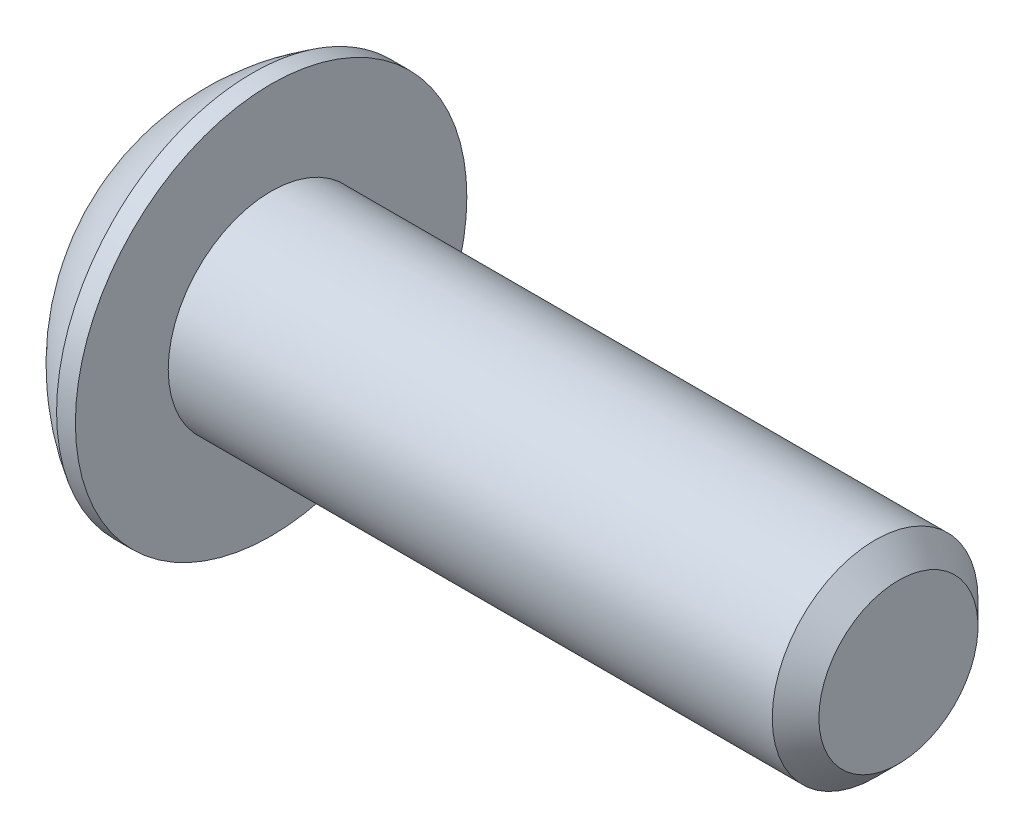
ISO-10303-21;
HEADER;
FILE_DESCRIPTION(('STEP AP214'),'2;1');
FILE_NAME('part.step','',(''),(''),'','','');
FILE_SCHEMA(('AUTOMOTIVE_DESIGN { 1 0 10303 214 1 1 1 1 }'));
ENDSEC;
DATA;
#1=APPLICATION_CONTEXT('core data for automotive mechanical design processes');
#2=APPLICATION_PROTOCOL_DEFINITION('international standard','automotive_design',2000,#1);
#3=PRODUCT_CONTEXT('',#1,'mechanical');
#4=PRODUCT('Part','Part','',(#3));
#5=PRODUCT_RELATED_PRODUCT_CATEGORY('part','',(#4));
#6=PRODUCT_DEFINITION_FORMATION('','',#4);
#7=PRODUCT_DEFINITION_CONTEXT('part definition',#1,'design');
#8=PRODUCT_DEFINITION('design','',#6,#7);
#9=PRODUCT_DEFINITION_SHAPE('','',#8);
#10=(LENGTH_UNIT() NAMED_UNIT(*) SI_UNIT(.MILLI.,.METRE.));
#11=(NAMED_UNIT(*) PLANE_ANGLE_UNIT() SI_UNIT($,.RADIAN.));
#12=(NAMED_UNIT(*) SI_UNIT($,.STERADIAN.) SOLID_ANGLE_UNIT());
#13=UNCERTAINTY_MEASURE_WITH_UNIT(LENGTH_MEASURE(1.E-05),#10,'distance_accuracy_value','');
#14=(GEOMETRIC_REPRESENTATION_CONTEXT(3) GLOBAL_UNCERTAINTY_ASSIGNED_CONTEXT((#13)) GLOBAL_UNIT_ASSIGNED_CONTEXT((#10,
#11,#12)) REPRESENTATION_CONTEXT('',''));
#15=CARTESIAN_POINT('',(0.,0.,0.));
#16=DIRECTION('',(0.,0.,1.));
#17=DIRECTION('',(1.,0.,0.));
#18=AXIS2_PLACEMENT_3D('',#15,#16,#17);
#19=CARTESIAN_POINT('',(1.32080000000034,0.,0.));
#20=DIRECTION('',(-1.,0.,0.));
#21=DIRECTION('',(0.,0.,1.));
#22=AXIS2_PLACEMENT_3D('',#19,#20,#21);
#23=CONICAL_SURFACE('',#22,1.1937999999998,1.04719755119608);
#24=CARTESIAN_POINT('',(2.01004075135902,0.,4.44089209850063E-13));
#25=VERTEX_POINT('',#24);
#26=VERTEX_LOOP('',#25);
#27=FACE_BOUND('',#26,.T.);
#28=CARTESIAN_POINT('',(1.32080000000009,0.,0.));
#29=DIRECTION('',(-1.,0.,0.));
#30=DIRECTION('',(0.,0.,1.));
#31=AXIS2_PLACEMENT_3D('',#28,#29,#30);
#32=CIRCLE('',#31,1.19380000000024);
#33=CARTESIAN_POINT('',(1.32080000000004,0.,1.19380000000012));
#34=VERTEX_POINT('',#33);
#35=CARTESIAN_POINT('',(1.32080000000004,-1.03386112703797,0.596900000000061));
#36=VERTEX_POINT('',#35);
#37=EDGE_CURVE('E19',#34,#36,#32,.F.);
#38=ORIENTED_EDGE('',*,*,#37,.F.);
#39=CARTESIAN_POINT('',(1.32080000000009,0.,0.));
#40=DIRECTION('',(-1.,0.,0.));
#41=DIRECTION('',(0.,0.,1.));
#42=AXIS2_PLACEMENT_3D('',#39,#40,#41);
#43=CIRCLE('',#42,1.19380000000024);
#44=CARTESIAN_POINT('',(1.32080000000004,1.03386112703797,0.596900000000063));
#45=VERTEX_POINT('',#44);
#46=EDGE_CURVE('E89',#45,#34,#43,.F.);
#47=ORIENTED_EDGE('',*,*,#46,.F.);
#48=CARTESIAN_POINT('',(1.32080000000009,0.,0.));
#49=DIRECTION('',(-1.,0.,0.));
#50=DIRECTION('',(0.,0.,1.));
#51=AXIS2_PLACEMENT_3D('',#48,#49,#50);
#52=CIRCLE('',#51,1.19380000000024);
#53=CARTESIAN_POINT('',(1.32080000000004,1.03386112703797,-0.596900000000063));
#54=VERTEX_POINT('',#53);
#55=EDGE_CURVE('E105',#54,#45,#52,.F.);
#56=ORIENTED_EDGE('',*,*,#55,.F.);
#57=CARTESIAN_POINT('',(1.32080000000009,0.,0.));
#58=DIRECTION('',(-1.,0.,0.));
#59=DIRECTION('',(0.,0.,1.));
#60=AXIS2_PLACEMENT_3D('',#57,#58,#59);
#61=CIRCLE('',#60,1.19380000000024);
#62=CARTESIAN_POINT('',(1.32080000000004,1.49420287879031E-12,-1.19380000000012));
#63=VERTEX_POINT('',#62);
#64=EDGE_CURVE('E448',#63,#54,#61,.F.);
#65=ORIENTED_EDGE('',*,*,#64,.F.);
#66=CARTESIAN_POINT('',(1.32080000000009,0.,0.));
#67=DIRECTION('',(-1.,0.,0.));
#68=DIRECTION('',(0.,0.,1.));
#69=AXIS2_PLACEMENT_3D('',#66,#67,#68);
#70=CIRCLE('',#69,1.19380000000024);
#71=CARTESIAN_POINT('',(1.32080000000004,-1.03386112703797,-0.596900000000062));
#72=VERTEX_POINT('',#71);
#73=EDGE_CURVE('E451',#72,#63,#70,.F.);
#74=ORIENTED_EDGE('',*,*,#73,.F.);
#75=CARTESIAN_POINT('',(1.32080000000009,0.,0.));
#76=DIRECTION('',(-1.,0.,0.));
#77=DIRECTION('',(0.,0.,1.));
#78=AXIS2_PLACEMENT_3D('',#75,#76,#77);
#79=CIRCLE('',#78,1.19380000000024);
#80=EDGE_CURVE('E92',#36,#72,#79,.F.);
#81=ORIENTED_EDGE('',*,*,#80,.F.);
#82=EDGE_LOOP('',(#38,#47,#56,#65,#74,#81));
#83=FACE_BOUND('',#82,.T.);
#84=ADVANCED_FACE('F16',(#27,#83),#23,.F.);
#85=CARTESIAN_POINT('',(1.3208,0.,2.3876));
#86=DIRECTION('',(-1.,0.,0.));
#87=DIRECTION('',(0.,0.,1.));
#88=AXIS2_PLACEMENT_3D('',#85,#86,#87);
#89=PLANE('',#88);
#90=DIRECTION('',(0.,1.,0.));
#91=VECTOR('',#90,1.);
#92=CARTESIAN_POINT('',(1.3208,-0.689240751358576,1.1938));
#93=LINE('',#92,#91);
#94=CARTESIAN_POINT('',(1.3208,-0.689240751358576,1.1938));
#95=VERTEX_POINT('',#94);
#96=EDGE_CURVE('E108',#34,#95,#93,.F.);
#97=ORIENTED_EDGE('',*,*,#96,.F.);
#98=ORIENTED_EDGE('',*,*,#37,.T.);
#99=DIRECTION('',(0.,0.5,0.866025403784439));
#100=VECTOR('',#99,1.);
#101=CARTESIAN_POINT('',(1.3208,-1.37848150271715,0.));
#102=LINE('',#101,#100);
#103=EDGE_CURVE('E111',#95,#36,#102,.F.);
#104=ORIENTED_EDGE('',*,*,#103,.F.);
#105=EDGE_LOOP('',(#97,#98,#104));
#106=FACE_BOUND('',#105,.T.);
#107=ADVANCED_FACE('F109',(#106),#89,.T.);
#108=CARTESIAN_POINT('',(1.3208,0.,2.3876));
#109=DIRECTION('',(-1.,0.,0.));
#110=DIRECTION('',(0.,0.,1.));
#111=AXIS2_PLACEMENT_3D('',#108,#109,#110);
#112=PLANE('',#111);
#113=DIRECTION('',(0.,0.5,0.866025403784439));
#114=VECTOR('',#113,1.);
#115=CARTESIAN_POINT('',(1.3208,-1.37848150271715,0.));
#116=LINE('',#115,#114);
#117=CARTESIAN_POINT('',(1.3208,-1.37848150271715,0.));
#118=VERTEX_POINT('',#117);
#119=EDGE_CURVE('E171',#36,#118,#116,.F.);
#120=ORIENTED_EDGE('',*,*,#119,.F.);
#121=ORIENTED_EDGE('',*,*,#80,.T.);
#122=DIRECTION('',(0.,-0.5,0.866025403784439));
#123=VECTOR('',#122,1.);
#124=CARTESIAN_POINT('',(1.3208,-0.689240751358576,-1.1938));
#125=LINE('',#124,#123);
#126=EDGE_CURVE('E159',#118,#72,#125,.F.);
#127=ORIENTED_EDGE('',*,*,#126,.F.);
#128=EDGE_LOOP('',(#120,#121,#127));
#129=FACE_BOUND('',#128,.T.);
#130=ADVANCED_FACE('F248',(#129),#112,.T.);
#131=CARTESIAN_POINT('',(1.3208,0.,2.3876));
#132=DIRECTION('',(-1.,0.,0.));
#133=DIRECTION('',(0.,0.,1.));
#134=AXIS2_PLACEMENT_3D('',#131,#132,#133);
#135=PLANE('',#134);
#136=DIRECTION('',(0.,-0.5,0.866025403784439));
#137=VECTOR('',#136,1.);
#138=CARTESIAN_POINT('',(1.3208,-0.689240751358576,-1.1938));
#139=LINE('',#138,#137);
#140=CARTESIAN_POINT('',(1.3208,-0.689240751358576,-1.1938));
#141=VERTEX_POINT('',#140);
#142=EDGE_CURVE('E156',#72,#141,#139,.F.);
#143=ORIENTED_EDGE('',*,*,#142,.F.);
#144=ORIENTED_EDGE('',*,*,#73,.T.);
#145=DIRECTION('',(0.,-1.,0.));
#146=VECTOR('',#145,1.);
#147=CARTESIAN_POINT('',(1.3208,0.689240751358575,-1.1938));
#148=LINE('',#147,#146);
#149=EDGE_CURVE('E143',#141,#63,#148,.F.);
#150=ORIENTED_EDGE('',*,*,#149,.F.);
#151=EDGE_LOOP('',(#143,#144,#150));
#152=FACE_BOUND('',#151,.T.);
#153=ADVANCED_FACE('F244',(#152),#135,.T.);
#154=CARTESIAN_POINT('',(1.3208,0.,2.3876));
#155=DIRECTION('',(-1.,0.,0.));
#156=DIRECTION('',(0.,0.,1.));
#157=AXIS2_PLACEMENT_3D('',#154,#155,#156);
#158=PLANE('',#157);
#159=DIRECTION('',(0.,-1.,0.));
#160=VECTOR('',#159,1.);
#161=CARTESIAN_POINT('',(1.3208,0.689240751358575,-1.1938));
#162=LINE('',#161,#160);
#163=CARTESIAN_POINT('',(1.3208,0.689240751358575,-1.1938));
#164=VERTEX_POINT('',#163);
#165=EDGE_CURVE('E140',#63,#164,#162,.F.);
#166=ORIENTED_EDGE('',*,*,#165,.F.);
#167=ORIENTED_EDGE('',*,*,#64,.T.);
#168=DIRECTION('',(0.,-0.500000000000001,-0.866025403784438));
#169=VECTOR('',#168,1.);
#170=CARTESIAN_POINT('',(1.3208,1.37848150271715,0.));
#171=LINE('',#170,#169);
#172=EDGE_CURVE('E128',#164,#54,#171,.F.);
#173=ORIENTED_EDGE('',*,*,#172,.F.);
#174=EDGE_LOOP('',(#166,#167,#173));
#175=FACE_BOUND('',#174,.T.);
#176=ADVANCED_FACE('F240',(#175),#158,.T.);
#177=CARTESIAN_POINT('',(1.3208,0.,2.3876));
#178=DIRECTION('',(-1.,0.,0.));
#179=DIRECTION('',(0.,0.,1.));
#180=AXIS2_PLACEMENT_3D('',#177,#178,#179);
#181=PLANE('',#180);
#182=DIRECTION('',(0.,-0.500000000000001,-0.866025403784438));
#183=VECTOR('',#182,1.);
#184=CARTESIAN_POINT('',(1.3208,1.37848150271715,0.));
#185=LINE('',#184,#183);
#186=CARTESIAN_POINT('',(1.3208,1.37848150271715,0.));
#187=VERTEX_POINT('',#186);
#188=EDGE_CURVE('E125',#54,#187,#185,.F.);
#189=ORIENTED_EDGE('',*,*,#188,.F.);
#190=ORIENTED_EDGE('',*,*,#55,.T.);
#191=DIRECTION('',(0.,0.500000000000001,-0.866025403784438));
#192=VECTOR('',#191,1.);
#193=CARTESIAN_POINT('',(1.3208,0.689240751358575,1.1938));
#194=LINE('',#193,#192);
#195=EDGE_CURVE('E148',#187,#45,#194,.F.);
#196=ORIENTED_EDGE('',*,*,#195,.F.);
#197=EDGE_LOOP('',(#189,#190,#196));
#198=FACE_BOUND('',#197,.T.);
#199=ADVANCED_FACE('F237',(#198),#181,.T.);
#200=CARTESIAN_POINT('',(1.3208,0.,2.3876));
#201=DIRECTION('',(-1.,0.,0.));
#202=DIRECTION('',(0.,0.,1.));
#203=AXIS2_PLACEMENT_3D('',#200,#201,#202);
#204=PLANE('',#203);
#205=DIRECTION('',(0.,0.500000000000001,-0.866025403784438));
#206=VECTOR('',#205,1.);
#207=CARTESIAN_POINT('',(1.3208,0.689240751358575,1.1938));
#208=LINE('',#207,#206);
#209=CARTESIAN_POINT('',(1.3208,0.689240751358575,1.1938));
#210=VERTEX_POINT('',#209);
#211=EDGE_CURVE('E103',#45,#210,#208,.F.);
#212=ORIENTED_EDGE('',*,*,#211,.F.);
#213=ORIENTED_EDGE('',*,*,#46,.T.);
#214=DIRECTION('',(0.,1.,0.));
#215=VECTOR('',#214,1.);
#216=CARTESIAN_POINT('',(1.3208,-0.689240751358576,1.1938));
#217=LINE('',#216,#215);
#218=EDGE_CURVE('E100',#210,#34,#217,.F.);
#219=ORIENTED_EDGE('',*,*,#218,.F.);
#220=EDGE_LOOP('',(#212,#213,#219));
#221=FACE_BOUND('',#220,.T.);
#222=ADVANCED_FACE('F98',(#221),#204,.T.);
#223=CARTESIAN_POINT('',(1.3208,-0.689240751358576,1.1938));
#224=DIRECTION('',(0.,0.,-1.));
#225=DIRECTION('',(0.,1.,0.));
#226=AXIS2_PLACEMENT_3D('',#223,#224,#225);
#227=PLANE('',#226);
#228=DIRECTION('',(0.,1.,0.));
#229=VECTOR('',#228,1.);
#230=CARTESIAN_POINT('',(0.,0.,1.1938));
#231=LINE('',#230,#229);
#232=CARTESIAN_POINT('',(0.,0.689240751358575,1.1938));
#233=VERTEX_POINT('',#232);
#234=CARTESIAN_POINT('',(0.,-0.689240751358576,1.1938));
#235=VERTEX_POINT('',#234);
#236=EDGE_CURVE('E132',#233,#235,#231,.F.);
#237=ORIENTED_EDGE('',*,*,#236,.F.);
#238=DIRECTION('',(1.,0.,0.));
#239=VECTOR('',#238,1.);
#240=CARTESIAN_POINT('',(1.3208,0.689240751358575,1.1938));
#241=LINE('',#240,#239);
#242=EDGE_CURVE('E117',#210,#233,#241,.F.);
#243=ORIENTED_EDGE('',*,*,#242,.F.);
#244=ORIENTED_EDGE('',*,*,#218,.T.);
#245=ORIENTED_EDGE('',*,*,#96,.T.);
#246=DIRECTION('',(1.,0.,0.));
#247=VECTOR('',#246,1.);
#248=CARTESIAN_POINT('',(1.3208,-0.689240751358576,1.1938));
#249=LINE('',#248,#247);
#250=EDGE_CURVE('E168',#235,#95,#249,.T.);
#251=ORIENTED_EDGE('',*,*,#250,.F.);
#252=EDGE_LOOP('',(#237,#243,#244,#245,#251));
#253=FACE_BOUND('',#252,.T.);
#254=ADVANCED_FACE('F115',(#253),#227,.T.);
#255=CARTESIAN_POINT('',(1.3208,-1.37848150271715,0.));
#256=DIRECTION('',(0.,0.866025403784439,-0.5));
#257=DIRECTION('',(0.,0.5,0.866025403784439));
#258=AXIS2_PLACEMENT_3D('',#255,#256,#257);
#259=PLANE('',#258);
#260=DIRECTION('',(0.,-0.5,-0.866025403784439));
#261=VECTOR('',#260,1.);
#262=CARTESIAN_POINT('',(0.,-0.689240751358576,1.1938));
#263=LINE('',#262,#261);
#264=CARTESIAN_POINT('',(0.,-1.37848150271715,0.));
#265=VERTEX_POINT('',#264);
#266=EDGE_CURVE('E435',#235,#265,#263,.T.);
#267=ORIENTED_EDGE('',*,*,#266,.F.);
#268=ORIENTED_EDGE('',*,*,#250,.T.);
#269=ORIENTED_EDGE('',*,*,#103,.T.);
#270=ORIENTED_EDGE('',*,*,#119,.T.);
#271=DIRECTION('',(1.,0.,0.));
#272=VECTOR('',#271,1.);
#273=CARTESIAN_POINT('',(1.3208,-1.37848150271715,0.));
#274=LINE('',#273,#272);
#275=EDGE_CURVE('E153',#265,#118,#274,.T.);
#276=ORIENTED_EDGE('',*,*,#275,.F.);
#277=EDGE_LOOP('',(#267,#268,#269,#270,#276));
#278=FACE_BOUND('',#277,.T.);
#279=ADVANCED_FACE('F228',(#278),#259,.T.);
#280=CARTESIAN_POINT('',(1.3208,-0.689240751358576,-1.1938));
#281=DIRECTION('',(0.,0.866025403784439,0.5));
#282=DIRECTION('',(0.,-0.5,0.866025403784439));
#283=AXIS2_PLACEMENT_3D('',#280,#281,#282);
#284=PLANE('',#283);
#285=DIRECTION('',(0.,0.5,-0.866025403784439));
#286=VECTOR('',#285,1.);
#287=CARTESIAN_POINT('',(0.,-1.37848150271715,0.));
#288=LINE('',#287,#286);
#289=CARTESIAN_POINT('',(0.,-0.689240751358576,-1.1938));
#290=VERTEX_POINT('',#289);
#291=EDGE_CURVE('E432',#265,#290,#288,.T.);
#292=ORIENTED_EDGE('',*,*,#291,.F.);
#293=ORIENTED_EDGE('',*,*,#275,.T.);
#294=ORIENTED_EDGE('',*,*,#126,.T.);
#295=ORIENTED_EDGE('',*,*,#142,.T.);
#296=DIRECTION('',(1.,0.,0.));
#297=VECTOR('',#296,1.);
#298=CARTESIAN_POINT('',(1.3208,-0.689240751358576,-1.1938));
#299=LINE('',#298,#297);
#300=EDGE_CURVE('E137',#290,#141,#299,.T.);
#301=ORIENTED_EDGE('',*,*,#300,.F.);
#302=EDGE_LOOP('',(#292,#293,#294,#295,#301));
#303=FACE_BOUND('',#302,.T.);
#304=ADVANCED_FACE('F224',(#303),#284,.T.);
#305=CARTESIAN_POINT('',(1.3208,0.689240751358575,-1.1938));
#306=DIRECTION('',(0.,0.,1.));
#307=DIRECTION('',(0.,-1.,0.));
#308=AXIS2_PLACEMENT_3D('',#305,#306,#307);
#309=PLANE('',#308);
#310=DIRECTION('',(0.,1.,0.));
#311=VECTOR('',#310,1.);
#312=CARTESIAN_POINT('',(0.,0.,-1.1938));
#313=LINE('',#312,#311);
#314=CARTESIAN_POINT('',(0.,0.689240751358575,-1.1938));
#315=VERTEX_POINT('',#314);
#316=EDGE_CURVE('E429',#290,#315,#313,.T.);
#317=ORIENTED_EDGE('',*,*,#316,.F.);
#318=ORIENTED_EDGE('',*,*,#300,.T.);
#319=ORIENTED_EDGE('',*,*,#149,.T.);
#320=ORIENTED_EDGE('',*,*,#165,.T.);
#321=DIRECTION('',(1.,0.,0.));
#322=VECTOR('',#321,1.);
#323=CARTESIAN_POINT('',(1.3208,0.689240751358575,-1.1938));
#324=LINE('',#323,#322);
#325=EDGE_CURVE('E127',#315,#164,#324,.T.);
#326=ORIENTED_EDGE('',*,*,#325,.F.);
#327=EDGE_LOOP('',(#317,#318,#319,#320,#326));
#328=FACE_BOUND('',#327,.T.);
#329=ADVANCED_FACE('F221',(#328),#309,.T.);
#330=CARTESIAN_POINT('',(1.3208,1.37848150271715,0.));
#331=DIRECTION('',(0.,-0.866025403784438,0.500000000000001));
#332=DIRECTION('',(0.,-0.500000000000001,-0.866025403784438));
#333=AXIS2_PLACEMENT_3D('',#330,#331,#332);
#334=PLANE('',#333);
#335=DIRECTION('',(0.,0.500000000000001,0.866025403784438));
#336=VECTOR('',#335,1.);
#337=CARTESIAN_POINT('',(0.,0.689240751358575,-1.1938));
#338=LINE('',#337,#336);
#339=CARTESIAN_POINT('',(0.,1.37848150271715,0.));
#340=VERTEX_POINT('',#339);
#341=EDGE_CURVE('E426',#315,#340,#338,.T.);
#342=ORIENTED_EDGE('',*,*,#341,.F.);
#343=ORIENTED_EDGE('',*,*,#325,.T.);
#344=ORIENTED_EDGE('',*,*,#172,.T.);
#345=ORIENTED_EDGE('',*,*,#188,.T.);
#346=DIRECTION('',(1.,0.,0.));
#347=VECTOR('',#346,1.);
#348=CARTESIAN_POINT('',(1.3208,1.37848150271715,0.));
#349=LINE('',#348,#347);
#350=EDGE_CURVE('E34',#340,#187,#349,.T.);
#351=ORIENTED_EDGE('',*,*,#350,.F.);
#352=EDGE_LOOP('',(#342,#343,#344,#345,#351));
#353=FACE_BOUND('',#352,.T.);
#354=ADVANCED_FACE('F217',(#353),#334,.T.);
#355=CARTESIAN_POINT('',(1.3208,0.689240751358575,1.1938));
#356=DIRECTION('',(0.,-0.866025403784438,-0.500000000000001));
#357=DIRECTION('',(0.,0.500000000000001,-0.866025403784438));
#358=AXIS2_PLACEMENT_3D('',#355,#356,#357);
#359=PLANE('',#358);
#360=DIRECTION('',(0.,-0.500000000000001,0.866025403784438));
#361=VECTOR('',#360,1.);
#362=CARTESIAN_POINT('',(0.,1.37848150271715,0.));
#363=LINE('',#362,#361);
#364=EDGE_CURVE('E203',#340,#233,#363,.T.);
#365=ORIENTED_EDGE('',*,*,#364,.F.);
#366=ORIENTED_EDGE('',*,*,#350,.T.);
#367=ORIENTED_EDGE('',*,*,#195,.T.);
#368=ORIENTED_EDGE('',*,*,#211,.T.);
#369=ORIENTED_EDGE('',*,*,#242,.T.);
#370=EDGE_LOOP('',(#365,#366,#367,#368,#369));
#371=FACE_BOUND('',#370,.T.);
#372=ADVANCED_FACE('F213',(#371),#359,.T.);
#373=CARTESIAN_POINT('',(0.,0.,0.));
#374=DIRECTION('',(-1.,0.,0.));
#375=DIRECTION('',(0.,0.,1.));
#376=AXIS2_PLACEMENT_3D('',#373,#374,#375);
#377=PLANE('',#376);
#378=ORIENTED_EDGE('',*,*,#341,.T.);
#379=ORIENTED_EDGE('',*,*,#364,.T.);
#380=ORIENTED_EDGE('',*,*,#236,.T.);
#381=ORIENTED_EDGE('',*,*,#266,.T.);
#382=ORIENTED_EDGE('',*,*,#291,.T.);
#383=ORIENTED_EDGE('',*,*,#316,.T.);
#384=EDGE_LOOP('',(#378,#379,#380,#381,#382,#383));
#385=FACE_BOUND('',#384,.T.);
#386=CARTESIAN_POINT('',(0.,1.9812,0.));
#387=CARTESIAN_POINT('',(0.,1.9811996664299,0.0556258831179427));
#388=CARTESIAN_POINT('',(0.,1.97885520380442,0.111261989398606));
#389=CARTESIAN_POINT('',(0.,1.96949260169541,0.222149719830457));
#390=CARTESIAN_POINT('',(0.,1.96247308239605,0.277401225602895));
#391=CARTESIAN_POINT('',(0.,1.94379192841038,0.387209508139748));
#392=CARTESIAN_POINT('',(-1.85322082329397E-13,1.93212292489526,0.441765039546366));
#393=CARTESIAN_POINT('',(1.86340500299935E-13,1.90422331175315,0.549729449347494));
#394=CARTESIAN_POINT('',(6.9454332942222E-13,1.88798900035338,0.60313735920887));
#395=CARTESIAN_POINT('',(1.15501983691781E-12,1.832662144765,0.760839131321828));
#396=CARTESIAN_POINT('',(0.,1.78690023648845,0.862876433575428));
#397=CARTESIAN_POINT('',(0.,1.67887358150667,1.05780719540872));
#398=CARTESIAN_POINT('',(9.54250412037226E-13,1.6166082074585,1.15070030720801));
#399=CARTESIAN_POINT('',(5.94776955847561E-13,1.51224157140982,1.28116890915698));
#400=CARTESIAN_POINT('',(1.6313892700342E-13,1.4755970394354,1.32320451127027));
#401=CARTESIAN_POINT('',(-1.62114692902247E-13,1.39893832619713,1.40400288695709));
#402=CARTESIAN_POINT('',(0.,1.35892742784699,1.44276877695455));
#403=CARTESIAN_POINT('',(1.13761909658717E-13,1.23416504602197,1.55382272417904));
#404=CARTESIAN_POINT('',(0.,1.14466125559859,1.62089527952111));
#405=CARTESIAN_POINT('',(0.,0.955712144178163,1.73902218081179));
#406=CARTESIAN_POINT('',(0.,0.85626719823356,1.79007713076007));
#407=CARTESIAN_POINT('',(0.,0.65020634591084,1.87477637530953));
#408=CARTESIAN_POINT('',(0.,0.543590516134852,1.90842085586266));
#409=CARTESIAN_POINT('',(0.,0.326226155292017,1.95733039300656));
#410=CARTESIAN_POINT('',(0.,0.215477602157928,1.97259535144288));
#411=CARTESIAN_POINT('',(0.,-0.00701040587544747,1.98431697865418));
#412=CARTESIAN_POINT('',(0.,-0.118749860774735,1.98077364742916));
#413=CARTESIAN_POINT('',(0.,-0.340050178355486,1.95497485623824));
#414=CARTESIAN_POINT('',(0.,-0.449611052668256,1.93271949620217));
#415=CARTESIAN_POINT('',(0.,-0.663431110729174,1.87014138774524));
#416=CARTESIAN_POINT('',(0.,-0.767690237838521,1.82981844635272));
#417=CARTESIAN_POINT('',(0.,-0.968005760719347,1.73219968377097));
#418=CARTESIAN_POINT('',(0.,-1.0640618469811,1.6749032225164));
#419=CARTESIAN_POINT('',(0.,-1.19980276751283,1.57757371205873));
#420=CARTESIAN_POINT('',(0.,-1.24366557129213,1.54322665019465));
#421=CARTESIAN_POINT('',(0.,-1.32838995706696,1.47093063174263));
#422=CARTESIAN_POINT('',(0.,-1.36924860178706,1.43297823102439));
#423=CARTESIAN_POINT('',(0.,-1.48674671849223,1.31419842051173));
#424=CARTESIAN_POINT('',(0.,-1.55842832343237,1.22836221289312));
#425=CARTESIAN_POINT('',(0.,-1.6863396856475,1.04586168272493));
#426=CARTESIAN_POINT('',(0.,-1.7425700302488,0.949197771949771));
#427=CARTESIAN_POINT('',(0.,-1.8141614250401,0.79818260029868));
#428=CARTESIAN_POINT('',(0.,-1.83591780585875,0.746776203847788));
#429=CARTESIAN_POINT('',(0.,-1.87500754181092,0.642341081688633));
#430=CARTESIAN_POINT('',(0.,-1.89234447645404,0.589313708122844));
#431=CARTESIAN_POINT('',(0.,-1.92246053433555,0.482076273028393));
#432=CARTESIAN_POINT('',(0.,-1.93524685475118,0.427868224257508));
#433=CARTESIAN_POINT('',(0.,-1.95620937250494,0.31857815184461));
#434=CARTESIAN_POINT('',(0.,-1.96438692958147,0.26349639091287));
#435=CARTESIAN_POINT('',(0.,-1.97388528284653,0.173607715038557));
#436=CARTESIAN_POINT('',(0.,-1.97662743364426,0.138944718024997));
#437=CARTESIAN_POINT('',(0.,-1.98028489645283,0.0695224782566998));
#438=CARTESIAN_POINT('',(0.,-1.98120020846367,0.0347632355019629));
#439=CARTESIAN_POINT('',(0.,-1.9811996664299,-0.0556258831179439));
#440=CARTESIAN_POINT('',(0.,-1.97885520380442,-0.111261989398607));
#441=CARTESIAN_POINT('',(0.,-1.96949260169541,-0.222149719830459));
#442=CARTESIAN_POINT('',(0.,-1.96247308239606,-0.277401225602897));
#443=CARTESIAN_POINT('',(0.,-1.94379192841039,-0.387209508139749));
#444=CARTESIAN_POINT('',(-1.85687495073514E-13,-1.93212292489526,-0.441765039546367));
#445=CARTESIAN_POINT('',(1.86706210197E-13,-1.90422331175315,-0.549729449347495));
#446=CARTESIAN_POINT('',(6.95913223380081E-13,-1.88798900035338,-0.603137359208872));
#447=CARTESIAN_POINT('',(1.15748248033081E-12,-1.83266214476501,-0.760839131321831));
#448=CARTESIAN_POINT('',(0.,-1.78690023648846,-0.862876433575432));
#449=CARTESIAN_POINT('',(0.,-1.67887358150667,-1.05780719540872));
#450=CARTESIAN_POINT('',(9.5413180925305E-13,-1.6166082074585,-1.15070030720801));
#451=CARTESIAN_POINT('',(5.94836334946628E-13,-1.51224157140982,-1.28116890915698));
#452=CARTESIAN_POINT('',(1.63155382486304E-13,-1.4755970394354,-1.32320451127027));
#453=CARTESIAN_POINT('',(-1.62131132519566E-13,-1.39893832619713,-1.40400288695709));
#454=CARTESIAN_POINT('',(0.,-1.35892742784699,-1.44276877695455));
#455=CARTESIAN_POINT('',(1.13774829743125E-13,-1.23416504602197,-1.55382272417904));
#456=CARTESIAN_POINT('',(0.,-1.14466125559859,-1.62089527952111));
#457=CARTESIAN_POINT('',(0.,-0.955712144178159,-1.73902218081179));
#458=CARTESIAN_POINT('',(0.,-0.856267198233559,-1.79007713076007));
#459=CARTESIAN_POINT('',(0.,-0.65020634591084,-1.87477637530954));
#460=CARTESIAN_POINT('',(0.,-0.543590516134851,-1.90842085586267));
#461=CARTESIAN_POINT('',(0.,-0.326226155292015,-1.95733039300656));
#462=CARTESIAN_POINT('',(0.,-0.215477602157927,-1.97259535144288));
#463=CARTESIAN_POINT('',(0.,0.00701040587544891,-1.98431697865418));
#464=CARTESIAN_POINT('',(0.,0.118749860774737,-1.98077364742916));
#465=CARTESIAN_POINT('',(0.,0.340050178355488,-1.95497485623824));
#466=CARTESIAN_POINT('',(0.,0.449611052668257,-1.93271949620217));
#467=CARTESIAN_POINT('',(0.,0.663431110729176,-1.87014138774523));
#468=CARTESIAN_POINT('',(0.,0.767690237838524,-1.82981844635272));
#469=CARTESIAN_POINT('',(0.,0.96800576071935,-1.73219968377097));
#470=CARTESIAN_POINT('',(0.,1.0640618469811,-1.6749032225164));
#471=CARTESIAN_POINT('',(0.,1.19980276751283,-1.57757371205873));
#472=CARTESIAN_POINT('',(0.,1.24366557129213,-1.54322665019465));
#473=CARTESIAN_POINT('',(0.,1.32838995706696,-1.47093063174263));
#474=CARTESIAN_POINT('',(0.,1.36924860178706,-1.43297823102439));
#475=CARTESIAN_POINT('',(0.,1.48674671849223,-1.31419842051172));
#476=CARTESIAN_POINT('',(0.,1.55842832343237,-1.22836221289311));
#477=CARTESIAN_POINT('',(0.,1.6863396856475,-1.04586168272493));
#478=CARTESIAN_POINT('',(0.,1.7425700302488,-0.949197771949772));
#479=CARTESIAN_POINT('',(0.,1.8141614250401,-0.798182600298681));
#480=CARTESIAN_POINT('',(0.,1.83591780585875,-0.746776203847787));
#481=CARTESIAN_POINT('',(0.,1.87500754181092,-0.642341081688632));
#482=CARTESIAN_POINT('',(0.,1.89234447645404,-0.589313708122843));
#483=CARTESIAN_POINT('',(0.,1.92246053433555,-0.482076273028391));
#484=CARTESIAN_POINT('',(0.,1.93524685475118,-0.427868224257506));
#485=CARTESIAN_POINT('',(0.,1.95620937250494,-0.318578151844607));
#486=CARTESIAN_POINT('',(0.,1.96438692958147,-0.263496390912867));
#487=CARTESIAN_POINT('',(0.,1.97388528284654,-0.173607715038555));
#488=CARTESIAN_POINT('',(0.,1.97662743364427,-0.138944718024995));
#489=CARTESIAN_POINT('',(0.,1.98028489645283,-0.0695224782566994));
#490=CARTESIAN_POINT('',(0.,1.98120020846367,-0.0347632355019632));
#491=CARTESIAN_POINT('',(0.,1.9812,0.));
#492=B_SPLINE_CURVE_WITH_KNOTS('',3,(#386,#387,#388,#389,#390,#391,#392,#393,#394,#395,#396,
#397,#398,#399,#400,#401,#402,#403,#404,#405,#406,#407,#408,#409,#410,#411,#412,#413,#414,#415,
#416,#417,#418,#419,#420,#421,#422,#423,#424,#425,#426,#427,#428,#429,#430,#431,#432,#433,#434,
#435,#436,#437,#438,#439,#440,#441,#442,#443,#444,#445,#446,#447,#448,#449,#450,#451,#452,#453,
#454,#455,#456,#457,#458,#459,#460,#461,#462,#463,#464,#465,#466,#467,#468,#469,#470,#471,#472,
#473,#474,#475,#476,#477,#478,#479,#480,#481,#482,#483,#484,#485,#486,#487,#488,#489,#490,#491),
.UNSPECIFIED.,.T.,.F.,(4,2,2,2,2,2,2,2,2,2,2,2,2,2,2,2,2,2,2,2,2,2,2,2,2,2,2,2,2,2,2,2,2,2,2,2,
2,2,2,2,2,2,2,2,2,2,2,2,2,2,2,2,4),(0.,0.166845646007828,0.333740557374255,0.500901034367694,
0.668197445942387,1.00199278686282,1.33580081809885,1.50292354032982,1.6698851310853,
2.00370118900129,2.33750465770544,2.67130456115909,3.00510624723801,3.33890793331696,
3.67270783677065,4.00651130547476,4.34032736339026,4.50728895414554,4.67441167637632,
5.00821970761259,5.34201504853332,5.50931146010827,5.67647193710191,5.84336684846844,
6.0102124944764,6.11448220058334,6.21875190669029,6.38559755269812,6.55249246406454,
6.71965294105798,6.88694935263267,7.22074469355311,7.55455272478914,7.72167544702011,
7.88863703777559,8.22245309569158,8.55625656439573,8.89005646784938,9.2238581539283,
9.55765984000725,9.89145974346094,10.225263212165,10.5590792700806,10.7260408608358,
10.8931635830666,11.2269716143029,11.5607669552236,11.7280633667986,11.8952238437922,
12.0621187551587,12.2289644011667,12.3332341072736,12.4375038133806),.UNSPECIFIED.);
#493=CARTESIAN_POINT('',(0.,1.9812,0.));
#494=VERTEX_POINT('',#493);
#495=EDGE_CURVE('E197',#494,#494,#492,.T.);
#496=ORIENTED_EDGE('',*,*,#495,.F.);
#497=EDGE_LOOP('',(#496));
#498=FACE_BOUND('',#497,.T.);
#499=ADVANCED_FACE('F209',(#385,#498),#377,.T.);
#500=CARTESIAN_POINT('',(4.13385,0.,0.));
#501=DIRECTION('',(0.,1.,0.));
#502=DIRECTION('',(1.,0.,0.));
#503=AXIS2_PLACEMENT_3D('',#500,#501,#502);
#504=SPHERICAL_SURFACE('',#503,4.58408870578439);
#505=CARTESIAN_POINT('',(1.8288,0.,0.));
#506=DIRECTION('',(-1.,0.,0.));
#507=DIRECTION('',(0.,0.,1.));
#508=AXIS2_PLACEMENT_3D('',#505,#506,#507);
#509=CIRCLE('',#508,3.9624);
#510=CARTESIAN_POINT('',(1.8288,0.,3.9624));
#511=VERTEX_POINT('',#510);
#512=EDGE_CURVE('E194',#511,#511,#509,.F.);
#513=ORIENTED_EDGE('',*,*,#512,.F.);
#514=EDGE_LOOP('',(#513));
#515=FACE_BOUND('',#514,.T.);
#516=ORIENTED_EDGE('',*,*,#495,.T.);
#517=EDGE_LOOP('',(#516));
#518=FACE_BOUND('',#517,.T.);
#519=ADVANCED_FACE('F205',(#515,#518),#504,.T.);
#520=CARTESIAN_POINT('',(14.9098,0.,0.));
#521=DIRECTION('',(-1.,0.,0.));
#522=DIRECTION('',(0.,0.,1.));
#523=AXIS2_PLACEMENT_3D('',#520,#521,#522);
#524=PLANE('',#523);
#525=CARTESIAN_POINT('',(14.9098000000549,0.,0.));
#526=DIRECTION('',(-1.,0.,0.));
#527=DIRECTION('',(0.,0.,1.));
#528=AXIS2_PLACEMENT_3D('',#525,#526,#527);
#529=CIRCLE('',#528,1.61036000002923);
#530=CARTESIAN_POINT('',(14.9098000000549,0.,1.61036000002923));
#531=VERTEX_POINT('',#530);
#532=EDGE_CURVE('E191',#531,#531,#529,.T.);
#533=ORIENTED_EDGE('',*,*,#532,.F.);
#534=EDGE_LOOP('',(#533));
#535=FACE_BOUND('',#534,.T.);
#536=ADVANCED_FACE('F276',(#535),#524,.F.);
#537=CARTESIAN_POINT('',(0.,0.,0.));
#538=DIRECTION('',(-1.,0.,0.));
#539=DIRECTION('',(0.,0.,1.));
#540=AXIS2_PLACEMENT_3D('',#537,#538,#539);
#541=CYLINDRICAL_SURFACE('',#540,3.9624);
#542=ORIENTED_EDGE('',*,*,#512,.T.);
#543=EDGE_LOOP('',(#542));
#544=FACE_BOUND('',#543,.T.);
#545=CARTESIAN_POINT('',(2.2098,0.,0.));
#546=DIRECTION('',(-1.,0.,0.));
#547=DIRECTION('',(0.,0.,1.));
#548=AXIS2_PLACEMENT_3D('',#545,#546,#547);
#549=CIRCLE('',#548,3.9624);
#550=CARTESIAN_POINT('',(2.2098,0.,3.9624));
#551=VERTEX_POINT('',#550);
#552=EDGE_CURVE('E188',#551,#551,#549,.T.);
#553=ORIENTED_EDGE('',*,*,#552,.T.);
#554=EDGE_LOOP('',(#553));
#555=FACE_BOUND('',#554,.T.);
#556=ADVANCED_FACE('F273',(#544,#555),#541,.T.);
#557=CARTESIAN_POINT('',(14.4373599999881,0.,0.));
#558=DIRECTION('',(-1.,0.,0.));
#559=DIRECTION('',(0.,0.,1.));
#560=AXIS2_PLACEMENT_3D('',#557,#558,#559);
#561=CONICAL_SURFACE('',#560,2.08280000003924,0.785398163337289);
#562=CARTESIAN_POINT('',(14.43736,0.,0.));
#563=DIRECTION('',(-1.,0.,0.));
#564=DIRECTION('',(0.,0.,1.));
#565=AXIS2_PLACEMENT_3D('',#562,#563,#564);
#566=CIRCLE('',#565,2.0828);
#567=CARTESIAN_POINT('',(14.43736,0.,2.0828));
#568=VERTEX_POINT('',#567);
#569=EDGE_CURVE('E25',#568,#568,#566,.T.);
#570=ORIENTED_EDGE('',*,*,#569,.F.);
#571=EDGE_LOOP('',(#570));
#572=FACE_BOUND('',#571,.T.);
#573=ORIENTED_EDGE('',*,*,#532,.T.);
#574=EDGE_LOOP('',(#573));
#575=FACE_BOUND('',#574,.T.);
#576=ADVANCED_FACE('F266',(#572,#575),#561,.T.);
#577=CARTESIAN_POINT('',(2.2098,2.0828,0.));
#578=DIRECTION('',(-1.,0.,0.));
#579=DIRECTION('',(0.,0.,1.));
#580=AXIS2_PLACEMENT_3D('',#577,#578,#579);
#581=PLANE('',#580);
#582=CARTESIAN_POINT('',(2.2098,0.,0.));
#583=DIRECTION('',(-1.,0.,0.));
#584=DIRECTION('',(0.,0.,1.));
#585=AXIS2_PLACEMENT_3D('',#582,#583,#584);
#586=CIRCLE('',#585,2.0828);
#587=CARTESIAN_POINT('',(2.2098,0.,2.0828));
#588=VERTEX_POINT('',#587);
#589=EDGE_CURVE('E11',#588,#588,#586,.F.);
#590=ORIENTED_EDGE('',*,*,#589,.F.);
#591=EDGE_LOOP('',(#590));
#592=FACE_BOUND('',#591,.T.);
#593=ORIENTED_EDGE('',*,*,#552,.F.);
#594=EDGE_LOOP('',(#593));
#595=FACE_BOUND('',#594,.T.);
#596=ADVANCED_FACE('F260',(#592,#595),#581,.F.);
#597=CARTESIAN_POINT('',(0.,0.,0.));
#598=DIRECTION('',(-1.,0.,0.));
#599=DIRECTION('',(0.,0.,1.));
#600=AXIS2_PLACEMENT_3D('',#597,#598,#599);
#601=CYLINDRICAL_SURFACE('',#600,2.0828);
#602=ORIENTED_EDGE('',*,*,#589,.T.);
#603=EDGE_LOOP('',(#602));
#604=FACE_BOUND('',#603,.T.);
#605=ORIENTED_EDGE('',*,*,#569,.T.);
#606=EDGE_LOOP('',(#605));
#607=FACE_BOUND('',#606,.T.);
#608=ADVANCED_FACE('F258',(#604,#607),#601,.T.);
#609=CLOSED_SHELL('',(#84,#107,#130,#153,#176,#199,#222,#254,#279,#304,#329,#354,#372,#499,#519,
#536,#556,#576,#596,#608));
#610=MANIFOLD_SOLID_BREP('B1',#609);
#611=ADVANCED_BREP_SHAPE_REPRESENTATION('',(#18,#610),#14);
#612=SHAPE_DEFINITION_REPRESENTATION(#9,#611);
ENDSEC;
END-ISO-10303-21;
